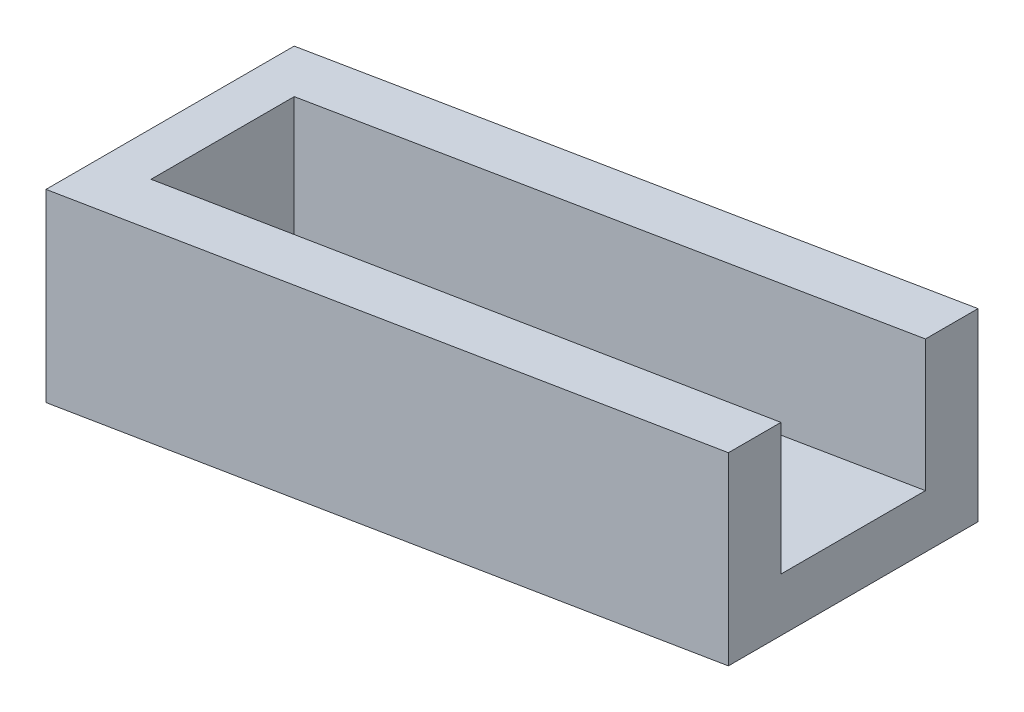
ISO-10303-21;
HEADER;
FILE_DESCRIPTION(('STEP AP214'),'2;1');
FILE_NAME('part.step','',(''),(''),'','','');
FILE_SCHEMA(('AUTOMOTIVE_DESIGN { 1 0 10303 214 1 1 1 1 }'));
ENDSEC;
DATA;
#1=APPLICATION_CONTEXT('core data for automotive mechanical design processes');
#2=APPLICATION_PROTOCOL_DEFINITION('international standard','automotive_design',2000,#1);
#3=PRODUCT_CONTEXT('',#1,'mechanical');
#4=PRODUCT('Part','Part','',(#3));
#5=PRODUCT_RELATED_PRODUCT_CATEGORY('part','',(#4));
#6=PRODUCT_DEFINITION_FORMATION('','',#4);
#7=PRODUCT_DEFINITION_CONTEXT('part definition',#1,'design');
#8=PRODUCT_DEFINITION('design','',#6,#7);
#9=PRODUCT_DEFINITION_SHAPE('','',#8);
#10=(LENGTH_UNIT() NAMED_UNIT(*) SI_UNIT(.MILLI.,.METRE.));
#11=(NAMED_UNIT(*) PLANE_ANGLE_UNIT() SI_UNIT($,.RADIAN.));
#12=(NAMED_UNIT(*) SI_UNIT($,.STERADIAN.) SOLID_ANGLE_UNIT());
#13=UNCERTAINTY_MEASURE_WITH_UNIT(LENGTH_MEASURE(1.E-05),#10,'distance_accuracy_value','');
#14=(GEOMETRIC_REPRESENTATION_CONTEXT(3) GLOBAL_UNCERTAINTY_ASSIGNED_CONTEXT((#13)) GLOBAL_UNIT_ASSIGNED_CONTEXT((#10,
#11,#12)) REPRESENTATION_CONTEXT('',''));
#15=CARTESIAN_POINT('',(0.,0.,0.));
#16=DIRECTION('',(0.,0.,1.));
#17=DIRECTION('',(1.,0.,0.));
#18=AXIS2_PLACEMENT_3D('',#15,#16,#17);
#19=CARTESIAN_POINT('',(-10.,0.,0.));
#20=DIRECTION('',(-1.,0.,0.));
#21=DIRECTION('',(0.,0.,1.));
#22=AXIS2_PLACEMENT_3D('',#19,#20,#21);
#23=PLANE('',#22);
#24=DIRECTION('',(0.,1.,0.));
#25=VECTOR('',#24,1.);
#26=CARTESIAN_POINT('',(-10.,0.,-23.6145887586791));
#27=LINE('',#26,#25);
#28=CARTESIAN_POINT('',(-10.,-24.3046042171637,-23.6145887586791));
#29=VERTEX_POINT('',#28);
#30=CARTESIAN_POINT('',(-10.,10.8333333333333,-23.6145887586791));
#31=VERTEX_POINT('',#30);
#32=EDGE_CURVE('E168',#29,#31,#27,.T.);
#33=ORIENTED_EDGE('',*,*,#32,.F.);
#34=DIRECTION('',(0.,0.,-1.));
#35=VECTOR('',#34,1.);
#36=CARTESIAN_POINT('',(-10.,-24.3046042171637,0.));
#37=LINE('',#36,#35);
#38=CARTESIAN_POINT('',(-10.,-24.3046042171637,23.6145887586791));
#39=VERTEX_POINT('',#38);
#40=EDGE_CURVE('E361',#39,#29,#37,.T.);
#41=ORIENTED_EDGE('',*,*,#40,.F.);
#42=DIRECTION('',(0.,-1.,0.));
#43=VECTOR('',#42,1.);
#44=CARTESIAN_POINT('',(-10.,0.,23.6145887586791));
#45=LINE('',#44,#43);
#46=CARTESIAN_POINT('',(-10.,10.8333333333333,23.6145887586791));
#47=VERTEX_POINT('',#46);
#48=EDGE_CURVE('E207',#47,#39,#45,.T.);
#49=ORIENTED_EDGE('',*,*,#48,.F.);
#50=DIRECTION('',(0.,0.,1.));
#51=VECTOR('',#50,1.);
#52=CARTESIAN_POINT('',(-10.,10.8333333333333,0.));
#53=LINE('',#52,#51);
#54=EDGE_CURVE('E216',#31,#47,#53,.T.);
#55=ORIENTED_EDGE('',*,*,#54,.F.);
#56=EDGE_LOOP('',(#33,#41,#49,#55));
#57=FACE_BOUND('',#56,.T.);
#58=ADVANCED_FACE('F54',(#57),#23,.T.);
#59=CARTESIAN_POINT('',(120.,0.,0.));
#60=DIRECTION('',(1.,0.,0.));
#61=DIRECTION('',(0.,0.,-1.));
#62=AXIS2_PLACEMENT_3D('',#59,#60,#61);
#63=PLANE('',#62);
#64=DIRECTION('',(0.,-1.,0.));
#65=VECTOR('',#64,1.);
#66=CARTESIAN_POINT('',(120.,7.5,13.75));
#67=LINE('',#66,#65);
#68=CARTESIAN_POINT('',(120.,32.5,13.75));
#69=VERTEX_POINT('',#68);
#70=CARTESIAN_POINT('',(120.,7.5,13.75));
#71=VERTEX_POINT('',#70);
#72=EDGE_CURVE('E140',#69,#71,#67,.T.);
#73=ORIENTED_EDGE('',*,*,#72,.F.);
#74=CARTESIAN_POINT('',(120.,32.5,13.75));
#75=DIRECTION('',(0.,0.,1.));
#76=VECTOR('',#75,1.);
#77=LINE('',#74,#76);
#78=CARTESIAN_POINT('',(120.,32.5,23.7500054253457));
#79=VERTEX_POINT('',#78);
#80=EDGE_CURVE('E158',#69,#79,#77,.T.);
#81=ORIENTED_EDGE('',*,*,#80,.T.);
#82=DIRECTION('',(0.,-1.,0.));
#83=VECTOR('',#82,1.);
#84=CARTESIAN_POINT('',(120.,0.,23.7500054253457));
#85=LINE('',#84,#83);
#86=CARTESIAN_POINT('',(120.,-2.63793755049703,23.7500054253457));
#87=VERTEX_POINT('',#86);
#88=EDGE_CURVE('E210',#79,#87,#85,.T.);
#89=ORIENTED_EDGE('',*,*,#88,.T.);
#90=DIRECTION('',(0.,0.,-1.));
#91=VECTOR('',#90,1.);
#92=CARTESIAN_POINT('',(120.,-2.63793755049703,0.));
#93=LINE('',#92,#91);
#94=CARTESIAN_POINT('',(120.,-2.63793755049703,-23.7500054253458));
#95=VERTEX_POINT('',#94);
#96=EDGE_CURVE('E221',#87,#95,#93,.T.);
#97=ORIENTED_EDGE('',*,*,#96,.T.);
#98=DIRECTION('',(0.,1.,0.));
#99=VECTOR('',#98,1.);
#100=CARTESIAN_POINT('',(120.,0.,-23.7500054253458));
#101=LINE('',#100,#99);
#102=CARTESIAN_POINT('',(120.,32.5,-23.7500054253458));
#103=VERTEX_POINT('',#102);
#104=EDGE_CURVE('E157',#95,#103,#101,.T.);
#105=ORIENTED_EDGE('',*,*,#104,.T.);
#106=CARTESIAN_POINT('',(120.,32.5,-23.7500054253458));
#107=DIRECTION('',(0.,0.,1.));
#108=VECTOR('',#107,1.);
#109=LINE('',#106,#108);
#110=CARTESIAN_POINT('',(120.,32.5,-13.75));
#111=VERTEX_POINT('',#110);
#112=EDGE_CURVE('E146',#103,#111,#109,.T.);
#113=ORIENTED_EDGE('',*,*,#112,.T.);
#114=DIRECTION('',(0.,1.,0.));
#115=VECTOR('',#114,1.);
#116=CARTESIAN_POINT('',(120.,7.5,-13.75));
#117=LINE('',#116,#115);
#118=CARTESIAN_POINT('',(120.,7.5,-13.75));
#119=VERTEX_POINT('',#118);
#120=EDGE_CURVE('E128',#119,#111,#117,.T.);
#121=ORIENTED_EDGE('',*,*,#120,.F.);
#122=DIRECTION('',(0.,0.,-1.));
#123=VECTOR('',#122,1.);
#124=CARTESIAN_POINT('',(120.,7.5,-13.75));
#125=LINE('',#124,#123);
#126=EDGE_CURVE('E139',#71,#119,#125,.T.);
#127=ORIENTED_EDGE('',*,*,#126,.F.);
#128=EDGE_LOOP('',(#73,#81,#89,#97,#105,#113,#121,#127));
#129=FACE_BOUND('',#128,.T.);
#130=ADVANCED_FACE('F155',(#129),#63,.T.);
#131=CARTESIAN_POINT('',(-0.0246093539485452,0.,-23.6249797906021));
#132=DIRECTION('',(-0.00104166610152685,0.,-0.999999457465719));
#133=DIRECTION('',(-0.999999457465719,0.,0.00104166610152685));
#134=AXIS2_PLACEMENT_3D('',#131,#132,#133);
#135=PLANE('',#134);
#136=DIRECTION('',(-0.986393403143196,-0.164398900523866,0.00102749312827422));
#137=VECTOR('',#136,1.);
#138=CARTESIAN_POINT('',(3.64706878745695,-22.0300927525875,-23.6288044553327));
#139=LINE('',#138,#137);
#140=EDGE_CURVE('E233',#95,#29,#139,.T.);
#141=ORIENTED_EDGE('',*,*,#140,.T.);
#142=ORIENTED_EDGE('',*,*,#32,.T.);
#143=DIRECTION('',(-0.986393403143196,-0.164398900523866,0.00102749312827422));
#144=VECTOR('',#143,1.);
#145=CARTESIAN_POINT('',(-2.05096912398565,12.1581718126691,-23.6228689991749));
#146=LINE('',#145,#144);
#147=EDGE_CURVE('E217',#103,#31,#146,.T.);
#148=ORIENTED_EDGE('',*,*,#147,.F.);
#149=ORIENTED_EDGE('',*,*,#104,.F.);
#150=EDGE_LOOP('',(#141,#142,#148,#149));
#151=FACE_BOUND('',#150,.T.);
#152=ADVANCED_FACE('F179',(#151),#135,.T.);
#153=CARTESIAN_POINT('',(-2.02702702702703,12.1621621621622,0.));
#154=DIRECTION('',(-0.164398987305357,0.986393923832144,0.));
#155=DIRECTION('',(-0.986393923832144,-0.164398987305357,0.));
#156=AXIS2_PLACEMENT_3D('',#153,#154,#155);
#157=PLANE('',#156);
#158=DIRECTION('',(-0.986393403143196,-0.164398900523866,0.00102749312827422));
#159=VECTOR('',#158,1.);
#160=CARTESIAN_POINT('',(120.,32.5,-13.75));
#161=LINE('',#160,#159);
#162=CARTESIAN_POINT('',(0.,12.5,-13.625));
#163=VERTEX_POINT('',#162);
#164=EDGE_CURVE('E132',#111,#163,#161,.T.);
#165=ORIENTED_EDGE('',*,*,#164,.F.);
#166=ORIENTED_EDGE('',*,*,#112,.F.);
#167=ORIENTED_EDGE('',*,*,#147,.T.);
#168=ORIENTED_EDGE('',*,*,#54,.T.);
#169=DIRECTION('',(-0.986393403143196,-0.164398900523866,-0.00102749312827413));
#170=VECTOR('',#169,1.);
#171=CARTESIAN_POINT('',(-2.05096912398565,12.1581718126691,23.6228689991749));
#172=LINE('',#171,#170);
#173=EDGE_CURVE('E206',#79,#47,#172,.T.);
#174=ORIENTED_EDGE('',*,*,#173,.F.);
#175=ORIENTED_EDGE('',*,*,#80,.F.);
#176=DIRECTION('',(-0.986393403143196,-0.164398900523866,-0.00102749312827413));
#177=VECTOR('',#176,1.);
#178=CARTESIAN_POINT('',(120.,32.5,13.75));
#179=LINE('',#178,#177);
#180=CARTESIAN_POINT('',(0.,12.5,13.625));
#181=VERTEX_POINT('',#180);
#182=EDGE_CURVE('E241',#69,#181,#179,.T.);
#183=ORIENTED_EDGE('',*,*,#182,.T.);
#184=DIRECTION('',(0.,0.,1.));
#185=VECTOR('',#184,1.);
#186=CARTESIAN_POINT('',(0.,12.5,13.625));
#187=LINE('',#186,#185);
#188=EDGE_CURVE('E150',#163,#181,#187,.T.);
#189=ORIENTED_EDGE('',*,*,#188,.F.);
#190=EDGE_LOOP('',(#165,#166,#167,#168,#174,#175,#183,#189));
#191=FACE_BOUND('',#190,.T.);
#192=ADVANCED_FACE('F144',(#191),#157,.T.);
#193=CARTESIAN_POINT('',(3.6710169000806,-22.0261014004836,0.));
#194=DIRECTION('',(0.164398987305357,-0.986393923832144,0.));
#195=DIRECTION('',(0.986393923832144,0.164398987305357,0.));
#196=AXIS2_PLACEMENT_3D('',#193,#194,#195);
#197=PLANE('',#196);
#198=CARTESIAN_POINT('',(12.0499604235296,-20.6296108132421,0.));
#199=DIRECTION('',(-0.164398987305357,0.986393923832144,0.));
#200=DIRECTION('',(-0.986393923832144,-0.164398987305357,0.));
#201=AXIS2_PLACEMENT_3D('',#198,#199,#200);
#202=CIRCLE('',#201,8.5);
#203=CARTESIAN_POINT('',(3.66561207095635,-22.0270022053376,0.));
#204=VERTEX_POINT('',#203);
#205=EDGE_CURVE('E334',#204,#204,#202,.T.);
#206=ORIENTED_EDGE('',*,*,#205,.T.);
#207=EDGE_LOOP('',(#206));
#208=FACE_BOUND('',#207,.T.);
#209=DIRECTION('',(-0.986393403143196,-0.164398900523866,-0.00102749312827413));
#210=VECTOR('',#209,1.);
#211=CARTESIAN_POINT('',(3.64706878745695,-22.0300927525875,23.6288044553327));
#212=LINE('',#211,#210);
#213=EDGE_CURVE('E213',#87,#39,#212,.T.);
#214=ORIENTED_EDGE('',*,*,#213,.T.);
#215=ORIENTED_EDGE('',*,*,#40,.T.);
#216=ORIENTED_EDGE('',*,*,#140,.F.);
#217=ORIENTED_EDGE('',*,*,#96,.F.);
#218=EDGE_LOOP('',(#214,#215,#216,#217));
#219=FACE_BOUND('',#218,.T.);
#220=ADVANCED_FACE('F186',(#208,#219),#197,.T.);
#221=CARTESIAN_POINT('',(-0.0246093539485431,0.,23.6249797906021));
#222=DIRECTION('',(-0.00104166610152676,0.,0.999999457465719));
#223=DIRECTION('',(0.999999457465719,0.,0.00104166610152676));
#224=AXIS2_PLACEMENT_3D('',#221,#222,#223);
#225=PLANE('',#224);
#226=ORIENTED_EDGE('',*,*,#173,.T.);
#227=ORIENTED_EDGE('',*,*,#48,.T.);
#228=ORIENTED_EDGE('',*,*,#213,.F.);
#229=ORIENTED_EDGE('',*,*,#88,.F.);
#230=EDGE_LOOP('',(#226,#227,#228,#229));
#231=FACE_BOUND('',#230,.T.);
#232=ADVANCED_FACE('F194',(#231),#225,.T.);
#233=CARTESIAN_POINT('',(0.,0.,0.));
#234=DIRECTION('',(-1.,0.,0.));
#235=DIRECTION('',(0.,0.,1.));
#236=AXIS2_PLACEMENT_3D('',#233,#234,#235);
#237=PLANE('',#236);
#238=DIRECTION('',(0.,1.,0.));
#239=VECTOR('',#238,1.);
#240=CARTESIAN_POINT('',(0.,-12.5,-13.625));
#241=LINE('',#240,#239);
#242=CARTESIAN_POINT('',(0.,-12.5,-13.625));
#243=VERTEX_POINT('',#242);
#244=EDGE_CURVE('E238',#243,#163,#241,.T.);
#245=ORIENTED_EDGE('',*,*,#244,.T.);
#246=ORIENTED_EDGE('',*,*,#188,.T.);
#247=DIRECTION('',(0.,-1.,0.));
#248=VECTOR('',#247,1.);
#249=CARTESIAN_POINT('',(0.,-12.5,13.625));
#250=LINE('',#249,#248);
#251=CARTESIAN_POINT('',(0.,-12.5,13.625));
#252=VERTEX_POINT('',#251);
#253=EDGE_CURVE('E326',#181,#252,#250,.T.);
#254=ORIENTED_EDGE('',*,*,#253,.T.);
#255=DIRECTION('',(0.,0.,-1.));
#256=VECTOR('',#255,1.);
#257=CARTESIAN_POINT('',(0.,-12.5,13.625));
#258=LINE('',#257,#256);
#259=CARTESIAN_POINT('',(0.,-12.5,8.42365014804085));
#260=VERTEX_POINT('',#259);
#261=EDGE_CURVE('E226',#252,#260,#258,.T.);
#262=ORIENTED_EDGE('',*,*,#261,.T.);
#263=CARTESIAN_POINT('',(0.,-12.5,8.42365014804086));
#264=CARTESIAN_POINT('',(0.,-12.6233606074366,8.20321276086822));
#265=CARTESIAN_POINT('',(0.,-12.7441581336424,7.98131958304355));
#266=CARTESIAN_POINT('',(0.,-12.9799079005927,7.53437610087838));
#267=CARTESIAN_POINT('',(0.,-13.0948585437845,7.3093249548849));
#268=CARTESIAN_POINT('',(0.,-13.3185460519516,6.85508977346369));
#269=CARTESIAN_POINT('',(0.,-13.4272580068865,6.62589340728883));
#270=CARTESIAN_POINT('',(0.,-13.637092350113,6.16408262756368));
#271=CARTESIAN_POINT('',(0.,-13.7382152778287,5.93146845835706));
#272=CARTESIAN_POINT('',(0.,-14.0307881041065,5.22341392604344));
#273=CARTESIAN_POINT('',(0.,-14.2091089759528,4.74241101612568));
#274=CARTESIAN_POINT('',(0.,-14.5214827445791,3.76671875154208));
#275=CARTESIAN_POINT('',(0.,-14.6556005103746,3.27205061764249));
#276=CARTESIAN_POINT('',(0.,-14.8421926550561,2.40297331004625));
#277=CARTESIAN_POINT('',(0.,-14.9068652589452,2.03118725351867));
#278=CARTESIAN_POINT('',(0.,-15.0042267562433,1.28335561266126));
#279=CARTESIAN_POINT('',(0.,-15.0369146651948,0.907309897583674));
#280=CARTESIAN_POINT('',(0.,-15.0684517907947,0.156237153917222));
#281=CARTESIAN_POINT('',(0.,-15.0675189250144,-0.218780683670689));
#282=CARTESIAN_POINT('',(0.,-15.0323948561902,-0.96728572634508));
#283=CARTESIAN_POINT('',(0.,-14.9982019054299,-1.34077284996153));
#284=CARTESIAN_POINT('',(0.,-14.9177526334825,-1.93929607057903));
#285=CARTESIAN_POINT('',(0.,-14.8813225197237,-2.16571196660332));
#286=CARTESIAN_POINT('',(0.,-14.7973631269056,-2.61648469946736));
#287=CARTESIAN_POINT('',(0.,-14.7498331480279,-2.84084140555307));
#288=CARTESIAN_POINT('',(0.,-14.591688918133,-3.51035340442305));
#289=CARTESIAN_POINT('',(0.,-14.4655289807197,-3.9518892384835));
#290=CARTESIAN_POINT('',(0.,-14.1778493110682,-4.82577696553868));
#291=CARTESIAN_POINT('',(0.,-14.0161342593528,-5.2580630563709));
#292=CARTESIAN_POINT('',(0.,-13.6644538317138,-6.11076879081355));
#293=CARTESIAN_POINT('',(0.,-13.4744949841258,-6.53119114998596));
#294=CARTESIAN_POINT('',(0.,-13.1515284952162,-7.19697912797054));
#295=CARTESIAN_POINT('',(0.,-13.0256773152369,-7.44587238045031));
#296=CARTESIAN_POINT('',(0.,-12.7675486495856,-7.93829068703942));
#297=CARTESIAN_POINT('',(0.,-12.6353171875105,-8.1818398321586));
#298=CARTESIAN_POINT('',(0.,-12.5,-8.42365014804089));
#299=B_SPLINE_CURVE_WITH_KNOTS('',3,(#263,#264,#265,#266,#267,#268,#269,#270,#271,#272,#273,
#274,#275,#276,#277,#278,#279,#280,#281,#282,#283,#284,#285,#286,#287,#288,#289,#290,#291,#292,
#293,#294,#295,#296,#297,#298),.UNSPECIFIED.,.F.,.F.,(4,2,2,2,2,2,2,2,2,2,2,2,2,2,2,2,2,4),(0.,
0.757831504269065,1.51586897176637,2.27674820973963,3.03757331350766,4.57479576002496,
6.1097521489975,7.2406257006377,8.37153405835486,9.49511360790944,10.618752201342,
11.3064750308814,11.9942412313238,13.3699586835831,14.7534312635935,16.1365845602786,
16.9731865106566,17.8044612468004),.UNSPECIFIED.);
#300=CARTESIAN_POINT('',(0.,-12.5,-8.42365014804088));
#301=VERTEX_POINT('',#300);
#302=EDGE_CURVE('E12',#260,#301,#299,.T.);
#303=ORIENTED_EDGE('',*,*,#302,.T.);
#304=EDGE_CURVE('E60',#301,#243,#258,.T.);
#305=ORIENTED_EDGE('',*,*,#304,.T.);
#306=EDGE_LOOP('',(#245,#246,#254,#262,#303,#305));
#307=FACE_BOUND('',#306,.T.);
#308=ADVANCED_FACE('F180',(#307),#237,.F.);
#309=CARTESIAN_POINT('',(-0.0141926929332767,0.,-13.6249852159449));
#310=DIRECTION('',(-0.00104166610152685,0.,-0.999999457465719));
#311=DIRECTION('',(-0.999999457465719,0.,0.00104166610152685));
#312=AXIS2_PLACEMENT_3D('',#309,#310,#311);
#313=PLANE('',#312);
#314=DIRECTION('',(-0.986393403143196,-0.164398900523866,0.00102749312827422));
#315=VECTOR('',#314,1.);
#316=CARTESIAN_POINT('',(120.,7.5,-13.75));
#317=LINE('',#316,#315);
#318=EDGE_CURVE('E135',#119,#243,#317,.T.);
#319=ORIENTED_EDGE('',*,*,#318,.F.);
#320=ORIENTED_EDGE('',*,*,#120,.T.);
#321=ORIENTED_EDGE('',*,*,#164,.T.);
#322=ORIENTED_EDGE('',*,*,#244,.F.);
#323=EDGE_LOOP('',(#319,#320,#321,#322));
#324=FACE_BOUND('',#323,.T.);
#325=ADVANCED_FACE('F130',(#324),#313,.F.);
#326=CARTESIAN_POINT('',(2.02702702702703,-12.1621621621622,0.));
#327=DIRECTION('',(0.164398987305357,-0.986393923832144,0.));
#328=DIRECTION('',(0.986393923832144,0.164398987305357,0.));
#329=AXIS2_PLACEMENT_3D('',#326,#327,#328);
#330=PLANE('',#329);
#331=ORIENTED_EDGE('',*,*,#304,.F.);
#332=CARTESIAN_POINT('',(10.405970550476,-10.7656715749207,0.));
#333=DIRECTION('',(0.164398987305357,-0.986393923832144,0.));
#334=DIRECTION('',(0.986393923832144,0.164398987305357,0.));
#335=AXIS2_PLACEMENT_3D('',#332,#333,#334);
#336=CIRCLE('',#335,13.5);
#337=EDGE_CURVE('E66',#301,#260,#336,.T.);
#338=ORIENTED_EDGE('',*,*,#337,.T.);
#339=ORIENTED_EDGE('',*,*,#261,.F.);
#340=DIRECTION('',(-0.986393403143196,-0.164398900523866,-0.00102749312827413));
#341=VECTOR('',#340,1.);
#342=CARTESIAN_POINT('',(120.,7.5,13.75));
#343=LINE('',#342,#341);
#344=EDGE_CURVE('E151',#71,#252,#343,.T.);
#345=ORIENTED_EDGE('',*,*,#344,.F.);
#346=ORIENTED_EDGE('',*,*,#126,.T.);
#347=ORIENTED_EDGE('',*,*,#318,.T.);
#348=EDGE_LOOP('',(#331,#338,#339,#345,#346,#347));
#349=FACE_BOUND('',#348,.T.);
#350=ADVANCED_FACE('F278',(#349),#330,.F.);
#351=CARTESIAN_POINT('',(-0.0141926929332755,0.,13.6249852159449));
#352=DIRECTION('',(-0.00104166610152676,0.,0.999999457465719));
#353=DIRECTION('',(0.999999457465719,0.,0.00104166610152676));
#354=AXIS2_PLACEMENT_3D('',#351,#352,#353);
#355=PLANE('',#354);
#356=ORIENTED_EDGE('',*,*,#182,.F.);
#357=ORIENTED_EDGE('',*,*,#72,.T.);
#358=ORIENTED_EDGE('',*,*,#344,.T.);
#359=ORIENTED_EDGE('',*,*,#253,.F.);
#360=EDGE_LOOP('',(#356,#357,#358,#359));
#361=FACE_BOUND('',#360,.T.);
#362=ADVANCED_FACE('F287',(#361),#355,.F.);
#363=CARTESIAN_POINT('',(12.0499604235296,-20.6296108132421,0.));
#364=DIRECTION('',(-0.164398987305357,0.986393923832144,0.));
#365=DIRECTION('',(-0.986393923832144,-0.164398987305357,0.));
#366=AXIS2_PLACEMENT_3D('',#363,#364,#365);
#367=CYLINDRICAL_SURFACE('',#366,8.5);
#368=CARTESIAN_POINT('',(11.2279654870028,-15.6976411940815,0.));
#369=DIRECTION('',(0.164398987305357,-0.986393923832144,0.));
#370=DIRECTION('',(0.986393923832144,0.164398987305357,0.));
#371=AXIS2_PLACEMENT_3D('',#368,#369,#370);
#372=CIRCLE('',#371,8.5);
#373=CARTESIAN_POINT('',(19.612313839576,-14.3002498019859,0.));
#374=VERTEX_POINT('',#373);
#375=EDGE_CURVE('E263',#374,#374,#372,.F.);
#376=ORIENTED_EDGE('',*,*,#375,.T.);
#377=EDGE_LOOP('',(#376));
#378=FACE_BOUND('',#377,.T.);
#379=ORIENTED_EDGE('',*,*,#205,.F.);
#380=EDGE_LOOP('',(#379));
#381=FACE_BOUND('',#380,.T.);
#382=ADVANCED_FACE('F292',(#378,#381),#367,.F.);
#383=CARTESIAN_POINT('',(11.2279654870028,-15.6976411940815,0.));
#384=DIRECTION('',(-0.164398987305357,0.986393923832144,0.));
#385=DIRECTION('',(-0.986393923832144,-0.164398987305357,0.));
#386=AXIS2_PLACEMENT_3D('',#383,#384,#385);
#387=CONICAL_SURFACE('',#386,8.5,0.785398163397443);
#388=ORIENTED_EDGE('',*,*,#302,.F.);
#389=ORIENTED_EDGE('',*,*,#337,.F.);
#390=EDGE_LOOP('',(#388,#389));
#391=FACE_BOUND('',#390,.T.);
#392=ORIENTED_EDGE('',*,*,#375,.F.);
#393=EDGE_LOOP('',(#392));
#394=FACE_BOUND('',#393,.T.);
#395=ADVANCED_FACE('F57',(#391,#394),#387,.F.);
#396=CLOSED_SHELL('',(#58,#130,#152,#192,#220,#232,#308,#325,#350,#362,#382,#395));
#397=MANIFOLD_SOLID_BREP('B2',#396);
#398=ADVANCED_BREP_SHAPE_REPRESENTATION('',(#18,#397),#14);
#399=SHAPE_DEFINITION_REPRESENTATION(#9,#398);
ENDSEC;
END-ISO-10303-21;
